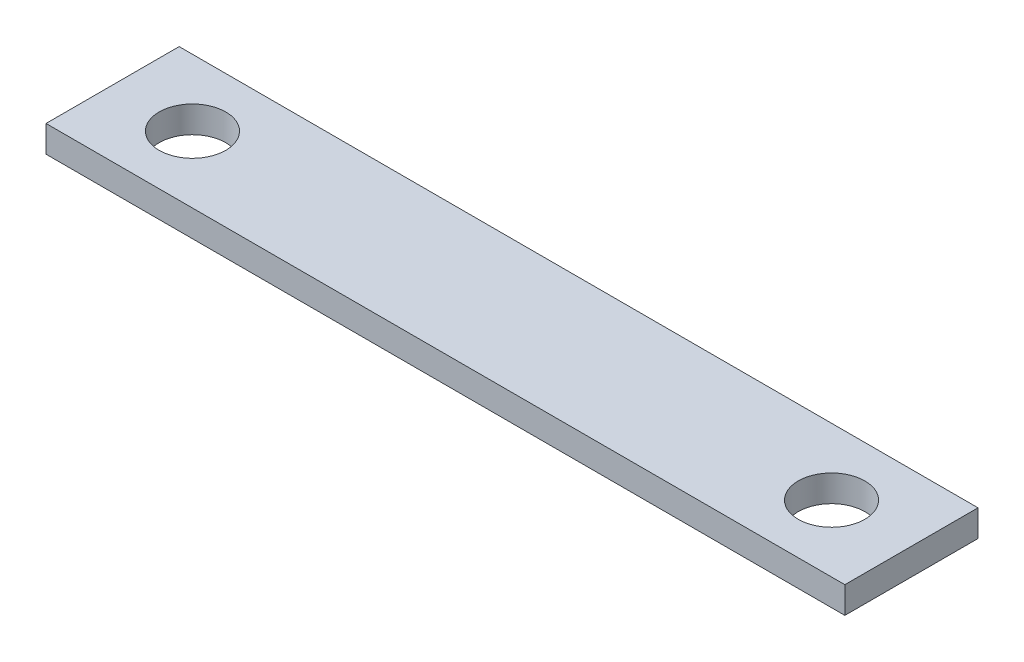
ISO-10303-21;
HEADER;
FILE_DESCRIPTION(('STEP AP214'),'2;1');
FILE_NAME('part.step','',(''),(''),'','','');
FILE_SCHEMA(('AUTOMOTIVE_DESIGN { 1 0 10303 214 1 1 1 1 }'));
ENDSEC;
DATA;
#1=APPLICATION_CONTEXT('core data for automotive mechanical design processes');
#2=APPLICATION_PROTOCOL_DEFINITION('international standard','automotive_design',2000,#1);
#3=PRODUCT_CONTEXT('',#1,'mechanical');
#4=PRODUCT('Part','Part','',(#3));
#5=PRODUCT_RELATED_PRODUCT_CATEGORY('part','',(#4));
#6=PRODUCT_DEFINITION_FORMATION('','',#4);
#7=PRODUCT_DEFINITION_CONTEXT('part definition',#1,'design');
#8=PRODUCT_DEFINITION('design','',#6,#7);
#9=PRODUCT_DEFINITION_SHAPE('','',#8);
#10=(LENGTH_UNIT() NAMED_UNIT(*) SI_UNIT(.MILLI.,.METRE.));
#11=(NAMED_UNIT(*) PLANE_ANGLE_UNIT() SI_UNIT($,.RADIAN.));
#12=(NAMED_UNIT(*) SI_UNIT($,.STERADIAN.) SOLID_ANGLE_UNIT());
#13=UNCERTAINTY_MEASURE_WITH_UNIT(LENGTH_MEASURE(1.E-05),#10,'distance_accuracy_value','');
#14=(GEOMETRIC_REPRESENTATION_CONTEXT(3) GLOBAL_UNCERTAINTY_ASSIGNED_CONTEXT((#13)) GLOBAL_UNIT_ASSIGNED_CONTEXT((#10,
#11,#12)) REPRESENTATION_CONTEXT('',''));
#15=CARTESIAN_POINT('',(0.,0.,0.));
#16=DIRECTION('',(0.,0.,1.));
#17=DIRECTION('',(1.,0.,0.));
#18=AXIS2_PLACEMENT_3D('',#15,#16,#17);
#19=CARTESIAN_POINT('',(0.,2.54,0.));
#20=DIRECTION('',(0.,-1.,0.));
#21=DIRECTION('',(0.,0.,-1.));
#22=AXIS2_PLACEMENT_3D('',#19,#20,#21);
#23=PLANE('',#22);
#24=DIRECTION('',(0.,0.,1.));
#25=VECTOR('',#24,1.);
#26=CARTESIAN_POINT('',(0.,2.54,0.));
#27=LINE('',#26,#25);
#28=CARTESIAN_POINT('',(0.,2.54,-12.7));
#29=VERTEX_POINT('',#28);
#30=CARTESIAN_POINT('',(0.,2.54,0.));
#31=VERTEX_POINT('',#30);
#32=EDGE_CURVE('E85',#29,#31,#27,.T.);
#33=ORIENTED_EDGE('',*,*,#32,.T.);
#34=DIRECTION('',(1.,0.,0.));
#35=VECTOR('',#34,1.);
#36=CARTESIAN_POINT('',(0.,2.54,0.));
#37=LINE('',#36,#35);
#38=CARTESIAN_POINT('',(76.2,2.54,0.));
#39=VERTEX_POINT('',#38);
#40=EDGE_CURVE('E80',#31,#39,#37,.T.);
#41=ORIENTED_EDGE('',*,*,#40,.T.);
#42=DIRECTION('',(0.,0.,-1.));
#43=VECTOR('',#42,1.);
#44=CARTESIAN_POINT('',(76.2,2.54,0.));
#45=LINE('',#44,#43);
#46=CARTESIAN_POINT('',(76.2,2.54,-12.7));
#47=VERTEX_POINT('',#46);
#48=EDGE_CURVE('E83',#39,#47,#45,.T.);
#49=ORIENTED_EDGE('',*,*,#48,.T.);
#50=DIRECTION('',(-1.,0.,0.));
#51=VECTOR('',#50,1.);
#52=CARTESIAN_POINT('',(0.,2.54,-12.7));
#53=LINE('',#52,#51);
#54=EDGE_CURVE('E50',#47,#29,#53,.T.);
#55=ORIENTED_EDGE('',*,*,#54,.T.);
#56=EDGE_LOOP('',(#33,#41,#49,#55));
#57=FACE_BOUND('',#56,.T.);
#58=CARTESIAN_POINT('',(7.62000000000001,2.54,-6.35));
#59=DIRECTION('',(0.,1.,0.));
#60=DIRECTION('',(0.,0.,1.));
#61=AXIS2_PLACEMENT_3D('',#58,#59,#60);
#62=CIRCLE('',#61,3.175);
#63=CARTESIAN_POINT('',(7.62000000000001,2.54,-3.175));
#64=VERTEX_POINT('',#63);
#65=EDGE_CURVE('E100',#64,#64,#62,.T.);
#66=ORIENTED_EDGE('',*,*,#65,.F.);
#67=EDGE_LOOP('',(#66));
#68=FACE_BOUND('',#67,.T.);
#69=CARTESIAN_POINT('',(68.58,2.54,-6.35000000000001));
#70=DIRECTION('',(0.,1.,0.));
#71=DIRECTION('',(0.,0.,-1.));
#72=AXIS2_PLACEMENT_3D('',#69,#70,#71);
#73=CIRCLE('',#72,3.175);
#74=CARTESIAN_POINT('',(68.58,2.54,-9.52500000000001));
#75=VERTEX_POINT('',#74);
#76=EDGE_CURVE('E115',#75,#75,#73,.T.);
#77=ORIENTED_EDGE('',*,*,#76,.F.);
#78=EDGE_LOOP('',(#77));
#79=FACE_BOUND('',#78,.T.);
#80=ADVANCED_FACE('F33',(#57,#68,#79),#23,.F.);
#81=CARTESIAN_POINT('',(0.,0.,0.));
#82=DIRECTION('',(0.,-1.,0.));
#83=DIRECTION('',(0.,0.,-1.));
#84=AXIS2_PLACEMENT_3D('',#81,#82,#83);
#85=PLANE('',#84);
#86=CARTESIAN_POINT('',(7.62000000000001,0.,-6.35));
#87=DIRECTION('',(0.,1.,0.));
#88=DIRECTION('',(0.,0.,1.));
#89=AXIS2_PLACEMENT_3D('',#86,#87,#88);
#90=CIRCLE('',#89,3.175);
#91=CARTESIAN_POINT('',(7.62000000000001,0.,-3.175));
#92=VERTEX_POINT('',#91);
#93=EDGE_CURVE('E112',#92,#92,#90,.T.);
#94=ORIENTED_EDGE('',*,*,#93,.T.);
#95=EDGE_LOOP('',(#94));
#96=FACE_BOUND('',#95,.T.);
#97=DIRECTION('',(0.,0.,1.));
#98=VECTOR('',#97,1.);
#99=CARTESIAN_POINT('',(0.,0.,0.));
#100=LINE('',#99,#98);
#101=CARTESIAN_POINT('',(0.,0.,-12.7));
#102=VERTEX_POINT('',#101);
#103=CARTESIAN_POINT('',(0.,0.,0.));
#104=VERTEX_POINT('',#103);
#105=EDGE_CURVE('E97',#102,#104,#100,.T.);
#106=ORIENTED_EDGE('',*,*,#105,.F.);
#107=DIRECTION('',(-1.,0.,0.));
#108=VECTOR('',#107,1.);
#109=CARTESIAN_POINT('',(0.,0.,-12.7));
#110=LINE('',#109,#108);
#111=CARTESIAN_POINT('',(76.2,0.,-12.7));
#112=VERTEX_POINT('',#111);
#113=EDGE_CURVE('E73',#112,#102,#110,.T.);
#114=ORIENTED_EDGE('',*,*,#113,.F.);
#115=DIRECTION('',(0.,0.,-1.));
#116=VECTOR('',#115,1.);
#117=CARTESIAN_POINT('',(76.2,0.,0.));
#118=LINE('',#117,#116);
#119=CARTESIAN_POINT('',(76.2,0.,0.));
#120=VERTEX_POINT('',#119);
#121=EDGE_CURVE('E67',#120,#112,#118,.T.);
#122=ORIENTED_EDGE('',*,*,#121,.F.);
#123=DIRECTION('',(1.,0.,0.));
#124=VECTOR('',#123,1.);
#125=CARTESIAN_POINT('',(0.,0.,0.));
#126=LINE('',#125,#124);
#127=EDGE_CURVE('E89',#104,#120,#126,.T.);
#128=ORIENTED_EDGE('',*,*,#127,.F.);
#129=EDGE_LOOP('',(#106,#114,#122,#128));
#130=FACE_BOUND('',#129,.T.);
#131=CARTESIAN_POINT('',(68.58,0.,-6.35000000000001));
#132=DIRECTION('',(0.,1.,0.));
#133=DIRECTION('',(0.,0.,-1.));
#134=AXIS2_PLACEMENT_3D('',#131,#132,#133);
#135=CIRCLE('',#134,3.175);
#136=CARTESIAN_POINT('',(68.58,0.,-9.52500000000001));
#137=VERTEX_POINT('',#136);
#138=EDGE_CURVE('E118',#137,#137,#135,.T.);
#139=ORIENTED_EDGE('',*,*,#138,.T.);
#140=EDGE_LOOP('',(#139));
#141=FACE_BOUND('',#140,.T.);
#142=ADVANCED_FACE('F108',(#96,#130,#141),#85,.T.);
#143=CARTESIAN_POINT('',(0.,2.54,0.));
#144=DIRECTION('',(1.,0.,0.));
#145=DIRECTION('',(0.,0.,-1.));
#146=AXIS2_PLACEMENT_3D('',#143,#144,#145);
#147=PLANE('',#146);
#148=ORIENTED_EDGE('',*,*,#105,.T.);
#149=DIRECTION('',(0.,-1.,0.));
#150=VECTOR('',#149,1.);
#151=CARTESIAN_POINT('',(0.,2.54,0.));
#152=LINE('',#151,#150);
#153=EDGE_CURVE('E11',#31,#104,#152,.T.);
#154=ORIENTED_EDGE('',*,*,#153,.F.);
#155=ORIENTED_EDGE('',*,*,#32,.F.);
#156=DIRECTION('',(0.,-1.,0.));
#157=VECTOR('',#156,1.);
#158=CARTESIAN_POINT('',(0.,2.54,-12.7));
#159=LINE('',#158,#157);
#160=EDGE_CURVE('E93',#29,#102,#159,.T.);
#161=ORIENTED_EDGE('',*,*,#160,.T.);
#162=EDGE_LOOP('',(#148,#154,#155,#161));
#163=FACE_BOUND('',#162,.T.);
#164=ADVANCED_FACE('F35',(#163),#147,.F.);
#165=CARTESIAN_POINT('',(0.,2.54,0.));
#166=DIRECTION('',(0.,0.,-1.));
#167=DIRECTION('',(-1.,0.,0.));
#168=AXIS2_PLACEMENT_3D('',#165,#166,#167);
#169=PLANE('',#168);
#170=ORIENTED_EDGE('',*,*,#127,.T.);
#171=DIRECTION('',(0.,-1.,0.));
#172=VECTOR('',#171,1.);
#173=CARTESIAN_POINT('',(76.2,2.54,0.));
#174=LINE('',#173,#172);
#175=EDGE_CURVE('E42',#39,#120,#174,.T.);
#176=ORIENTED_EDGE('',*,*,#175,.F.);
#177=ORIENTED_EDGE('',*,*,#40,.F.);
#178=ORIENTED_EDGE('',*,*,#153,.T.);
#179=EDGE_LOOP('',(#170,#176,#177,#178));
#180=FACE_BOUND('',#179,.T.);
#181=ADVANCED_FACE('F88',(#180),#169,.F.);
#182=CARTESIAN_POINT('',(76.2,2.54,0.));
#183=DIRECTION('',(-1.,0.,0.));
#184=DIRECTION('',(0.,0.,1.));
#185=AXIS2_PLACEMENT_3D('',#182,#183,#184);
#186=PLANE('',#185);
#187=ORIENTED_EDGE('',*,*,#121,.T.);
#188=DIRECTION('',(0.,-1.,0.));
#189=VECTOR('',#188,1.);
#190=CARTESIAN_POINT('',(76.2,2.54,-12.7));
#191=LINE('',#190,#189);
#192=EDGE_CURVE('E90',#47,#112,#191,.T.);
#193=ORIENTED_EDGE('',*,*,#192,.F.);
#194=ORIENTED_EDGE('',*,*,#48,.F.);
#195=ORIENTED_EDGE('',*,*,#175,.T.);
#196=EDGE_LOOP('',(#187,#193,#194,#195));
#197=FACE_BOUND('',#196,.T.);
#198=ADVANCED_FACE('F91',(#197),#186,.F.);
#199=CARTESIAN_POINT('',(0.,2.54,-12.7));
#200=DIRECTION('',(0.,0.,1.));
#201=DIRECTION('',(1.,0.,0.));
#202=AXIS2_PLACEMENT_3D('',#199,#200,#201);
#203=PLANE('',#202);
#204=ORIENTED_EDGE('',*,*,#113,.T.);
#205=ORIENTED_EDGE('',*,*,#160,.F.);
#206=ORIENTED_EDGE('',*,*,#54,.F.);
#207=ORIENTED_EDGE('',*,*,#192,.T.);
#208=EDGE_LOOP('',(#204,#205,#206,#207));
#209=FACE_BOUND('',#208,.T.);
#210=ADVANCED_FACE('F105',(#209),#203,.F.);
#211=CARTESIAN_POINT('',(7.62000000000001,2.54,-6.35));
#212=DIRECTION('',(0.,-1.,0.));
#213=DIRECTION('',(0.,0.,-1.));
#214=AXIS2_PLACEMENT_3D('',#211,#212,#213);
#215=CYLINDRICAL_SURFACE('',#214,3.175);
#216=ORIENTED_EDGE('',*,*,#65,.T.);
#217=EDGE_LOOP('',(#216));
#218=FACE_BOUND('',#217,.T.);
#219=ORIENTED_EDGE('',*,*,#93,.F.);
#220=EDGE_LOOP('',(#219));
#221=FACE_BOUND('',#220,.T.);
#222=ADVANCED_FACE('F135',(#218,#221),#215,.F.);
#223=CARTESIAN_POINT('',(68.58,2.54,-6.35000000000001));
#224=DIRECTION('',(0.,-1.,0.));
#225=DIRECTION('',(0.,0.,-1.));
#226=AXIS2_PLACEMENT_3D('',#223,#224,#225);
#227=CYLINDRICAL_SURFACE('',#226,3.175);
#228=ORIENTED_EDGE('',*,*,#76,.T.);
#229=EDGE_LOOP('',(#228));
#230=FACE_BOUND('',#229,.T.);
#231=ORIENTED_EDGE('',*,*,#138,.F.);
#232=EDGE_LOOP('',(#231));
#233=FACE_BOUND('',#232,.T.);
#234=ADVANCED_FACE('F124',(#230,#233),#227,.F.);
#235=CLOSED_SHELL('',(#80,#142,#164,#181,#198,#210,#222,#234));
#236=MANIFOLD_SOLID_BREP('B2',#235);
#237=ADVANCED_BREP_SHAPE_REPRESENTATION('',(#18,#236),#14);
#238=SHAPE_DEFINITION_REPRESENTATION(#9,#237);
ENDSEC;
END-ISO-10303-21;
